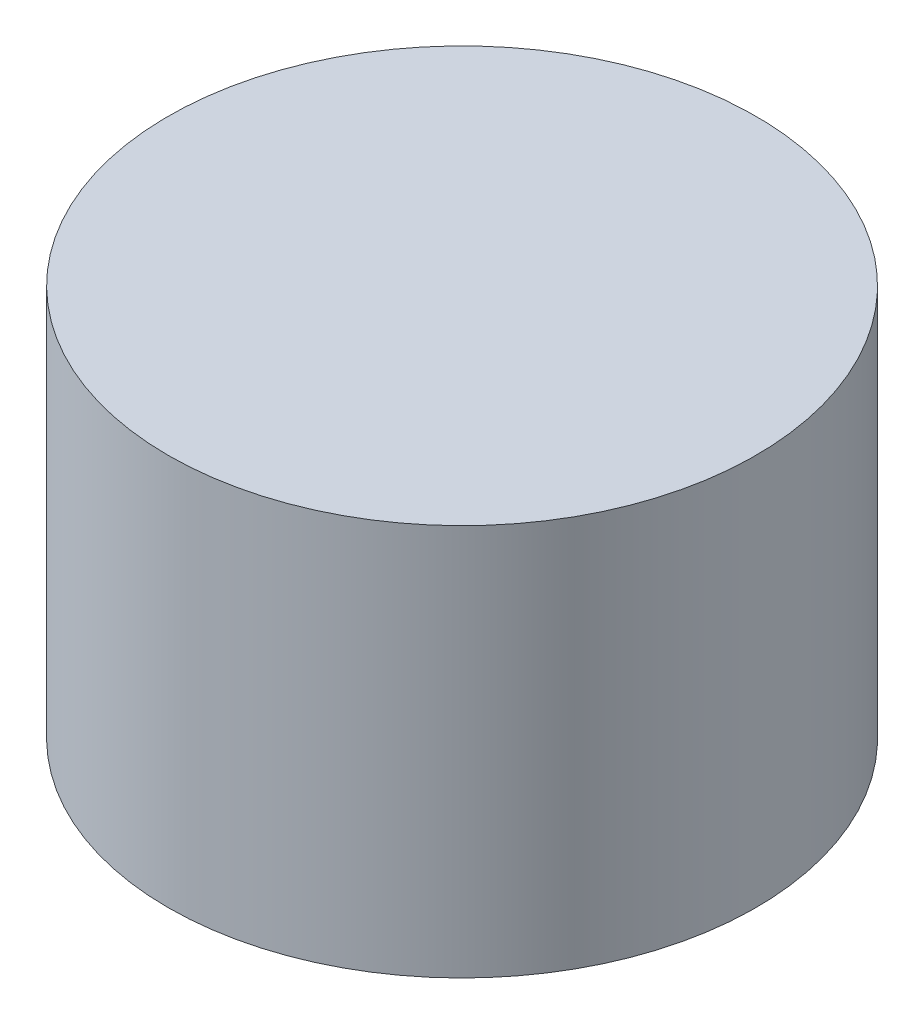
ISO-10303-21;
HEADER;
FILE_DESCRIPTION(('STEP AP214'),'2;1');
FILE_NAME('part.step','',(''),(''),'','','');
FILE_SCHEMA(('AUTOMOTIVE_DESIGN { 1 0 10303 214 1 1 1 1 }'));
ENDSEC;
DATA;
#1=APPLICATION_CONTEXT('core data for automotive mechanical design processes');
#2=APPLICATION_PROTOCOL_DEFINITION('international standard','automotive_design',2000,#1);
#3=PRODUCT_CONTEXT('',#1,'mechanical');
#4=PRODUCT('Part','Part','',(#3));
#5=PRODUCT_RELATED_PRODUCT_CATEGORY('part','',(#4));
#6=PRODUCT_DEFINITION_FORMATION('','',#4);
#7=PRODUCT_DEFINITION_CONTEXT('part definition',#1,'design');
#8=PRODUCT_DEFINITION('design','',#6,#7);
#9=PRODUCT_DEFINITION_SHAPE('','',#8);
#10=(LENGTH_UNIT() NAMED_UNIT(*) SI_UNIT(.MILLI.,.METRE.));
#11=(NAMED_UNIT(*) PLANE_ANGLE_UNIT() SI_UNIT($,.RADIAN.));
#12=(NAMED_UNIT(*) SI_UNIT($,.STERADIAN.) SOLID_ANGLE_UNIT());
#13=UNCERTAINTY_MEASURE_WITH_UNIT(LENGTH_MEASURE(1.E-05),#10,'distance_accuracy_value','');
#14=(GEOMETRIC_REPRESENTATION_CONTEXT(3) GLOBAL_UNCERTAINTY_ASSIGNED_CONTEXT((#13)) GLOBAL_UNIT_ASSIGNED_CONTEXT((#10,
#11,#12)) REPRESENTATION_CONTEXT('',''));
#15=CARTESIAN_POINT('',(0.,0.,0.));
#16=DIRECTION('',(0.,0.,1.));
#17=DIRECTION('',(1.,0.,0.));
#18=AXIS2_PLACEMENT_3D('',#15,#16,#17);
#19=CARTESIAN_POINT('',(0.,2.,0.));
#20=DIRECTION('',(0.,-1.,0.));
#21=DIRECTION('',(0.,0.,-1.));
#22=AXIS2_PLACEMENT_3D('',#19,#20,#21);
#23=CYLINDRICAL_SURFACE('',#22,1.5);
#24=CARTESIAN_POINT('',(0.,2.,0.));
#25=DIRECTION('',(0.,1.,0.));
#26=DIRECTION('',(0.,0.,1.));
#27=AXIS2_PLACEMENT_3D('',#24,#25,#26);
#28=CIRCLE('',#27,1.5);
#29=CARTESIAN_POINT('',(0.,2.,1.5));
#30=VERTEX_POINT('',#29);
#31=EDGE_CURVE('E10',#30,#30,#28,.T.);
#32=ORIENTED_EDGE('',*,*,#31,.F.);
#33=EDGE_LOOP('',(#32));
#34=FACE_BOUND('',#33,.T.);
#35=CARTESIAN_POINT('',(0.,0.,0.));
#36=DIRECTION('',(0.,1.,0.));
#37=DIRECTION('',(0.,0.,1.));
#38=AXIS2_PLACEMENT_3D('',#35,#36,#37);
#39=CIRCLE('',#38,1.5);
#40=CARTESIAN_POINT('',(0.,0.,1.5));
#41=VERTEX_POINT('',#40);
#42=EDGE_CURVE('E44',#41,#41,#39,.T.);
#43=ORIENTED_EDGE('',*,*,#42,.T.);
#44=EDGE_LOOP('',(#43));
#45=FACE_BOUND('',#44,.T.);
#46=ADVANCED_FACE('F41',(#34,#45),#23,.T.);
#47=CARTESIAN_POINT('',(0.,2.,0.));
#48=DIRECTION('',(0.,1.,0.));
#49=DIRECTION('',(0.,0.,1.));
#50=AXIS2_PLACEMENT_3D('',#47,#48,#49);
#51=PLANE('',#50);
#52=ORIENTED_EDGE('',*,*,#31,.T.);
#53=EDGE_LOOP('',(#52));
#54=FACE_BOUND('',#53,.T.);
#55=ADVANCED_FACE('F58',(#54),#51,.T.);
#56=CARTESIAN_POINT('',(0.,0.,0.));
#57=DIRECTION('',(0.,1.,0.));
#58=DIRECTION('',(0.,0.,1.));
#59=AXIS2_PLACEMENT_3D('',#56,#57,#58);
#60=PLANE('',#59);
#61=ORIENTED_EDGE('',*,*,#42,.F.);
#62=EDGE_LOOP('',(#61));
#63=FACE_BOUND('',#62,.T.);
#64=ADVANCED_FACE('F56',(#63),#60,.F.);
#65=CLOSED_SHELL('',(#46,#55,#64));
#66=MANIFOLD_SOLID_BREP('B2',#65);
#67=ADVANCED_BREP_SHAPE_REPRESENTATION('',(#18,#66),#14);
#68=SHAPE_DEFINITION_REPRESENTATION(#9,#67);
ENDSEC;
END-ISO-10303-21;
